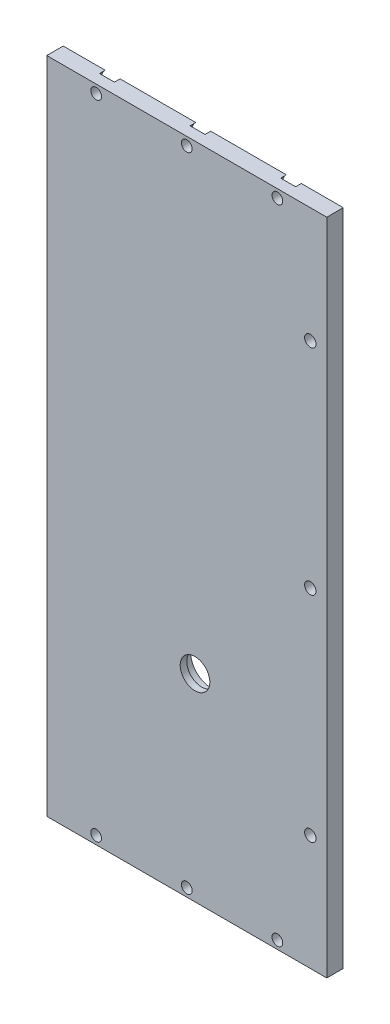
ISO-10303-21;
HEADER;
FILE_DESCRIPTION(('STEP AP214'),'2;1');
FILE_NAME('part.step','',(''),(''),'','','');
FILE_SCHEMA(('AUTOMOTIVE_DESIGN { 1 0 10303 214 1 1 1 1 }'));
ENDSEC;
DATA;
#1=APPLICATION_CONTEXT('core data for automotive mechanical design processes');
#2=APPLICATION_PROTOCOL_DEFINITION('international standard','automotive_design',2000,#1);
#3=PRODUCT_CONTEXT('',#1,'mechanical');
#4=PRODUCT('Part','Part','',(#3));
#5=PRODUCT_RELATED_PRODUCT_CATEGORY('part','',(#4));
#6=PRODUCT_DEFINITION_FORMATION('','',#4);
#7=PRODUCT_DEFINITION_CONTEXT('part definition',#1,'design');
#8=PRODUCT_DEFINITION('design','',#6,#7);
#9=PRODUCT_DEFINITION_SHAPE('','',#8);
#10=(LENGTH_UNIT() NAMED_UNIT(*) SI_UNIT(.MILLI.,.METRE.));
#11=(NAMED_UNIT(*) PLANE_ANGLE_UNIT() SI_UNIT($,.RADIAN.));
#12=(NAMED_UNIT(*) SI_UNIT($,.STERADIAN.) SOLID_ANGLE_UNIT());
#13=UNCERTAINTY_MEASURE_WITH_UNIT(LENGTH_MEASURE(1.E-05),#10,'distance_accuracy_value','');
#14=(GEOMETRIC_REPRESENTATION_CONTEXT(3) GLOBAL_UNCERTAINTY_ASSIGNED_CONTEXT((#13)) GLOBAL_UNIT_ASSIGNED_CONTEXT((#10,
#11,#12)) REPRESENTATION_CONTEXT('',''));
#15=CARTESIAN_POINT('',(0.,0.,0.));
#16=DIRECTION('',(0.,0.,1.));
#17=DIRECTION('',(1.,0.,0.));
#18=AXIS2_PLACEMENT_3D('',#15,#16,#17);
#19=CARTESIAN_POINT('',(0.,0.,0.));
#20=DIRECTION('',(0.,0.,1.));
#21=DIRECTION('',(1.,0.,0.));
#22=AXIS2_PLACEMENT_3D('',#19,#20,#21);
#23=PLANE('',#22);
#24=CARTESIAN_POINT('',(-113.363171355499,-48.1585677749361,0.));
#25=DIRECTION('',(0.,0.,-1.));
#26=DIRECTION('',(-1.,0.,0.));
#27=AXIS2_PLACEMENT_3D('',#24,#25,#26);
#28=CIRCLE('',#27,6.35);
#29=CARTESIAN_POINT('',(-119.713171355499,-48.1585677749361,0.));
#30=VERTEX_POINT('',#29);
#31=EDGE_CURVE('E704',#30,#30,#28,.T.);
#32=ORIENTED_EDGE('',*,*,#31,.F.);
#33=EDGE_LOOP('',(#32));
#34=FACE_BOUND('',#33,.T.);
#35=CARTESIAN_POINT('',(-78.3631713554987,-73.1585677749361,0.));
#36=DIRECTION('',(0.,0.,-1.));
#37=DIRECTION('',(-1.,0.,0.));
#38=AXIS2_PLACEMENT_3D('',#35,#36,#37);
#39=CIRCLE('',#38,3.37311999999999);
#40=CARTESIAN_POINT('',(-81.7362913554987,-73.1585677749361,0.));
#41=VERTEX_POINT('',#40);
#42=EDGE_CURVE('E312',#41,#41,#39,.T.);
#43=ORIENTED_EDGE('',*,*,#42,.F.);
#44=EDGE_LOOP('',(#43));
#45=FACE_BOUND('',#44,.T.);
#46=CARTESIAN_POINT('',(-78.3631713554987,-8.15856777493607,0.));
#47=DIRECTION('',(0.,0.,-1.));
#48=DIRECTION('',(-1.,0.,0.));
#49=AXIS2_PLACEMENT_3D('',#46,#47,#48);
#50=CIRCLE('',#49,3.37311999999999);
#51=CARTESIAN_POINT('',(-81.7362913554987,-8.15856777493607,0.));
#52=VERTEX_POINT('',#51);
#53=EDGE_CURVE('E296',#52,#52,#50,.T.);
#54=ORIENTED_EDGE('',*,*,#53,.F.);
#55=EDGE_LOOP('',(#54));
#56=FACE_BOUND('',#55,.T.);
#57=CARTESIAN_POINT('',(-78.3631713554987,56.8414322250639,0.));
#58=DIRECTION('',(0.,0.,-1.));
#59=DIRECTION('',(-1.,0.,0.));
#60=AXIS2_PLACEMENT_3D('',#57,#58,#59);
#61=CIRCLE('',#60,3.37311999999999);
#62=CARTESIAN_POINT('',(-81.7362913554987,56.8414322250639,0.));
#63=VERTEX_POINT('',#62);
#64=EDGE_CURVE('E280',#63,#63,#61,.T.);
#65=ORIENTED_EDGE('',*,*,#64,.F.);
#66=EDGE_LOOP('',(#65));
#67=FACE_BOUND('',#66,.T.);
#68=CARTESIAN_POINT('',(-88.3631713554986,89.341432225064,0.));
#69=DIRECTION('',(0.,0.,-1.));
#70=DIRECTION('',(-1.,0.,0.));
#71=AXIS2_PLACEMENT_3D('',#68,#69,#70);
#72=CIRCLE('',#71,3.37311999999999);
#73=CARTESIAN_POINT('',(-86.0986761502928,91.8414322250639,0.));
#74=VERTEX_POINT('',#73);
#75=CARTESIAN_POINT('',(-90.6276665607044,91.8414322250639,0.));
#76=VERTEX_POINT('',#75);
#77=EDGE_CURVE('E193',#74,#76,#72,.T.);
#78=ORIENTED_EDGE('',*,*,#77,.F.);
#79=DIRECTION('',(-1.,0.,0.));
#80=VECTOR('',#79,1.);
#81=CARTESIAN_POINT('',(-158.363171355499,91.8414322250639,0.));
#82=LINE('',#81,#80);
#83=CARTESIAN_POINT('',(-73.3631713554987,91.8414322250639,0.));
#84=VERTEX_POINT('',#83);
#85=EDGE_CURVE('E334',#84,#74,#82,.T.);
#86=ORIENTED_EDGE('',*,*,#85,.F.);
#87=DIRECTION('',(0.,1.,0.));
#88=VECTOR('',#87,1.);
#89=CARTESIAN_POINT('',(-73.3631713554987,91.8414322250639,0.));
#90=LINE('',#89,#88);
#91=CARTESIAN_POINT('',(-73.3631713554987,-108.158567774936,0.));
#92=VERTEX_POINT('',#91);
#93=EDGE_CURVE('E352',#92,#84,#90,.T.);
#94=ORIENTED_EDGE('',*,*,#93,.F.);
#95=DIRECTION('',(1.,0.,0.));
#96=VECTOR('',#95,1.);
#97=CARTESIAN_POINT('',(-158.363171355499,-108.158567774936,0.));
#98=LINE('',#97,#96);
#99=CARTESIAN_POINT('',(-86.0986761502929,-108.158567774936,0.));
#100=VERTEX_POINT('',#99);
#101=EDGE_CURVE('E347',#100,#92,#98,.T.);
#102=ORIENTED_EDGE('',*,*,#101,.F.);
#103=CARTESIAN_POINT('',(-88.3631713554987,-105.658567774936,0.));
#104=DIRECTION('',(0.,0.,-1.));
#105=DIRECTION('',(-1.,0.,0.));
#106=AXIS2_PLACEMENT_3D('',#103,#104,#105);
#107=CIRCLE('',#106,3.37311999999999);
#108=CARTESIAN_POINT('',(-90.6276665607044,-108.158567774936,0.));
#109=VERTEX_POINT('',#108);
#110=EDGE_CURVE('E265',#109,#100,#107,.T.);
#111=ORIENTED_EDGE('',*,*,#110,.F.);
#112=CARTESIAN_POINT('',(-113.598676150293,-108.158567774936,0.));
#113=VERTEX_POINT('',#112);
#114=EDGE_CURVE('E628',#113,#109,#98,.T.);
#115=ORIENTED_EDGE('',*,*,#114,.F.);
#116=CARTESIAN_POINT('',(-115.863171355499,-105.658567774936,0.));
#117=DIRECTION('',(0.,0.,-1.));
#118=DIRECTION('',(-1.,0.,0.));
#119=AXIS2_PLACEMENT_3D('',#116,#117,#118);
#120=CIRCLE('',#119,3.37311999999999);
#121=CARTESIAN_POINT('',(-118.127666560704,-108.158567774936,0.));
#122=VERTEX_POINT('',#121);
#123=EDGE_CURVE('E250',#122,#113,#120,.T.);
#124=ORIENTED_EDGE('',*,*,#123,.F.);
#125=CARTESIAN_POINT('',(-141.098676150293,-108.158567774936,0.));
#126=VERTEX_POINT('',#125);
#127=EDGE_CURVE('E353',#126,#122,#98,.T.);
#128=ORIENTED_EDGE('',*,*,#127,.F.);
#129=CARTESIAN_POINT('',(-143.363171355499,-105.658567774936,0.));
#130=DIRECTION('',(0.,0.,-1.));
#131=DIRECTION('',(-1.,0.,0.));
#132=AXIS2_PLACEMENT_3D('',#129,#130,#131);
#133=CIRCLE('',#132,3.37312000000001);
#134=CARTESIAN_POINT('',(-145.627666560704,-108.158567774936,0.));
#135=VERTEX_POINT('',#134);
#136=EDGE_CURVE('E236',#135,#126,#133,.T.);
#137=ORIENTED_EDGE('',*,*,#136,.F.);
#138=CARTESIAN_POINT('',(-158.363171355499,-108.158567774936,0.));
#139=VERTEX_POINT('',#138);
#140=EDGE_CURVE('E348',#139,#135,#98,.T.);
#141=ORIENTED_EDGE('',*,*,#140,.F.);
#142=DIRECTION('',(0.,-1.,0.));
#143=VECTOR('',#142,1.);
#144=CARTESIAN_POINT('',(-158.363171355499,91.8414322250639,0.));
#145=LINE('',#144,#143);
#146=CARTESIAN_POINT('',(-158.363171355499,91.8414322250639,0.));
#147=VERTEX_POINT('',#146);
#148=EDGE_CURVE('E328',#147,#139,#145,.T.);
#149=ORIENTED_EDGE('',*,*,#148,.F.);
#150=CARTESIAN_POINT('',(-145.627666560704,91.8414322250639,0.));
#151=VERTEX_POINT('',#150);
#152=EDGE_CURVE('E356',#151,#147,#82,.T.);
#153=ORIENTED_EDGE('',*,*,#152,.F.);
#154=CARTESIAN_POINT('',(-143.363171355499,89.341432225064,0.));
#155=DIRECTION('',(0.,0.,-1.));
#156=DIRECTION('',(-1.,0.,0.));
#157=AXIS2_PLACEMENT_3D('',#154,#155,#156);
#158=CIRCLE('',#157,3.37312000000001);
#159=CARTESIAN_POINT('',(-141.098676150293,91.8414322250639,0.));
#160=VERTEX_POINT('',#159);
#161=EDGE_CURVE('E220',#160,#151,#158,.T.);
#162=ORIENTED_EDGE('',*,*,#161,.F.);
#163=CARTESIAN_POINT('',(-118.127666560704,91.8414322250639,0.));
#164=VERTEX_POINT('',#163);
#165=EDGE_CURVE('E505',#164,#160,#82,.T.);
#166=ORIENTED_EDGE('',*,*,#165,.F.);
#167=CARTESIAN_POINT('',(-115.863171355499,89.341432225064,0.));
#168=DIRECTION('',(0.,0.,-1.));
#169=DIRECTION('',(-1.,0.,0.));
#170=AXIS2_PLACEMENT_3D('',#167,#168,#169);
#171=CIRCLE('',#170,3.37311999999999);
#172=CARTESIAN_POINT('',(-113.598676150293,91.8414322250639,0.));
#173=VERTEX_POINT('',#172);
#174=EDGE_CURVE('E206',#173,#164,#171,.T.);
#175=ORIENTED_EDGE('',*,*,#174,.F.);
#176=EDGE_CURVE('E360',#76,#173,#82,.T.);
#177=ORIENTED_EDGE('',*,*,#176,.F.);
#178=EDGE_LOOP('',(#78,#86,#94,#102,#111,#115,#124,#128,#137,#141,#149,#153,#162,#166,#175,#177));
#179=FACE_BOUND('',#178,.T.);
#180=ADVANCED_FACE('F47',(#34,#45,#56,#67,#179),#23,.F.);
#181=CARTESIAN_POINT('',(-158.363171355499,91.8414322250639,5.));
#182=DIRECTION('',(1.,0.,0.));
#183=DIRECTION('',(0.,1.,0.));
#184=AXIS2_PLACEMENT_3D('',#181,#182,#183);
#185=PLANE('',#184);
#186=CARTESIAN_POINT('',(-158.363171355499,-58.1585677749361,2.50000000000001));
#187=DIRECTION('',(-1.,0.,0.));
#188=DIRECTION('',(0.,0.,1.));
#189=AXIS2_PLACEMENT_3D('',#186,#187,#188);
#190=CIRCLE('',#189,1.13029999999999);
#191=CARTESIAN_POINT('',(-158.363171355499,-58.1585677749361,3.63029999999999));
#192=VERTEX_POINT('',#191);
#193=EDGE_CURVE('E178',#192,#192,#190,.T.);
#194=ORIENTED_EDGE('',*,*,#193,.F.);
#195=EDGE_LOOP('',(#194));
#196=FACE_BOUND('',#195,.T.);
#197=CARTESIAN_POINT('',(-158.363171355499,41.8414322250639,2.50000000000001));
#198=DIRECTION('',(-1.,0.,0.));
#199=DIRECTION('',(0.,0.,1.));
#200=AXIS2_PLACEMENT_3D('',#197,#198,#199);
#201=CIRCLE('',#200,1.13029999999999);
#202=CARTESIAN_POINT('',(-158.363171355499,41.8414322250639,3.63029999999999));
#203=VERTEX_POINT('',#202);
#204=EDGE_CURVE('E177',#203,#203,#201,.T.);
#205=ORIENTED_EDGE('',*,*,#204,.F.);
#206=EDGE_LOOP('',(#205));
#207=FACE_BOUND('',#206,.T.);
#208=ORIENTED_EDGE('',*,*,#148,.T.);
#209=DIRECTION('',(0.,0.,-1.));
#210=VECTOR('',#209,1.);
#211=CARTESIAN_POINT('',(-158.363171355499,-108.158567774936,5.));
#212=LINE('',#211,#210);
#213=CARTESIAN_POINT('',(-158.363171355499,-108.158567774936,5.));
#214=VERTEX_POINT('',#213);
#215=EDGE_CURVE('E372',#214,#139,#212,.T.);
#216=ORIENTED_EDGE('',*,*,#215,.F.);
#217=DIRECTION('',(0.,-1.,0.));
#218=VECTOR('',#217,1.);
#219=CARTESIAN_POINT('',(-158.363171355499,91.8414322250639,5.));
#220=LINE('',#219,#218);
#221=CARTESIAN_POINT('',(-158.363171355499,91.8414322250639,5.));
#222=VERTEX_POINT('',#221);
#223=EDGE_CURVE('E329',#222,#214,#220,.T.);
#224=ORIENTED_EDGE('',*,*,#223,.F.);
#225=DIRECTION('',(0.,0.,-1.));
#226=VECTOR('',#225,1.);
#227=CARTESIAN_POINT('',(-158.363171355499,91.8414322250639,5.));
#228=LINE('',#227,#226);
#229=EDGE_CURVE('E343',#222,#147,#228,.T.);
#230=ORIENTED_EDGE('',*,*,#229,.T.);
#231=EDGE_LOOP('',(#208,#216,#224,#230));
#232=FACE_BOUND('',#231,.T.);
#233=ADVANCED_FACE('F49',(#196,#207,#232),#185,.F.);
#234=CARTESIAN_POINT('',(-158.363171355499,-108.158567774936,5.));
#235=DIRECTION('',(0.,1.,0.));
#236=DIRECTION('',(0.,0.,1.));
#237=AXIS2_PLACEMENT_3D('',#234,#235,#236);
#238=PLANE('',#237);
#239=DIRECTION('',(1.,0.,0.));
#240=VECTOR('',#239,1.);
#241=CARTESIAN_POINT('',(-158.363171355499,-108.158567774936,1.7272));
#242=LINE('',#241,#240);
#243=CARTESIAN_POINT('',(-145.627666560704,-108.158567774936,1.7272));
#244=VERTEX_POINT('',#243);
#245=CARTESIAN_POINT('',(-141.098676150293,-108.158567774936,1.7272));
#246=VERTEX_POINT('',#245);
#247=EDGE_CURVE('E400',#244,#246,#242,.T.);
#248=ORIENTED_EDGE('',*,*,#247,.T.);
#249=DIRECTION('',(0.,0.,-1.));
#250=VECTOR('',#249,1.);
#251=CARTESIAN_POINT('',(-141.098676150293,-108.158567774936,0.));
#252=LINE('',#251,#250);
#253=EDGE_CURVE('E224',#246,#126,#252,.T.);
#254=ORIENTED_EDGE('',*,*,#253,.T.);
#255=ORIENTED_EDGE('',*,*,#127,.T.);
#256=DIRECTION('',(0.,0.,-1.));
#257=VECTOR('',#256,1.);
#258=CARTESIAN_POINT('',(-118.127666560704,-108.158567774936,0.));
#259=LINE('',#258,#257);
#260=CARTESIAN_POINT('',(-118.127666560704,-108.158567774936,1.7272));
#261=VERTEX_POINT('',#260);
#262=EDGE_CURVE('E388',#122,#261,#259,.F.);
#263=ORIENTED_EDGE('',*,*,#262,.T.);
#264=DIRECTION('',(1.,0.,0.));
#265=VECTOR('',#264,1.);
#266=CARTESIAN_POINT('',(-158.363171355499,-108.158567774936,1.7272));
#267=LINE('',#266,#265);
#268=CARTESIAN_POINT('',(-113.598676150293,-108.158567774936,1.7272));
#269=VERTEX_POINT('',#268);
#270=EDGE_CURVE('E392',#261,#269,#267,.T.);
#271=ORIENTED_EDGE('',*,*,#270,.T.);
#272=DIRECTION('',(0.,0.,-1.));
#273=VECTOR('',#272,1.);
#274=CARTESIAN_POINT('',(-113.598676150293,-108.158567774936,0.));
#275=LINE('',#274,#273);
#276=EDGE_CURVE('E396',#269,#113,#275,.T.);
#277=ORIENTED_EDGE('',*,*,#276,.T.);
#278=ORIENTED_EDGE('',*,*,#114,.T.);
#279=DIRECTION('',(0.,0.,-1.));
#280=VECTOR('',#279,1.);
#281=CARTESIAN_POINT('',(-90.6276665607044,-108.158567774936,0.));
#282=LINE('',#281,#280);
#283=CARTESIAN_POINT('',(-90.6276665607044,-108.158567774936,1.7272));
#284=VERTEX_POINT('',#283);
#285=EDGE_CURVE('E376',#109,#284,#282,.F.);
#286=ORIENTED_EDGE('',*,*,#285,.T.);
#287=DIRECTION('',(1.,0.,0.));
#288=VECTOR('',#287,1.);
#289=CARTESIAN_POINT('',(-158.363171355499,-108.158567774936,1.7272));
#290=LINE('',#289,#288);
#291=CARTESIAN_POINT('',(-86.0986761502929,-108.158567774936,1.7272));
#292=VERTEX_POINT('',#291);
#293=EDGE_CURVE('E380',#284,#292,#290,.T.);
#294=ORIENTED_EDGE('',*,*,#293,.T.);
#295=DIRECTION('',(0.,0.,-1.));
#296=VECTOR('',#295,1.);
#297=CARTESIAN_POINT('',(-86.0986761502929,-108.158567774936,0.));
#298=LINE('',#297,#296);
#299=EDGE_CURVE('E384',#292,#100,#298,.T.);
#300=ORIENTED_EDGE('',*,*,#299,.T.);
#301=ORIENTED_EDGE('',*,*,#101,.T.);
#302=DIRECTION('',(0.,0.,-1.));
#303=VECTOR('',#302,1.);
#304=CARTESIAN_POINT('',(-73.3631713554987,-108.158567774936,5.));
#305=LINE('',#304,#303);
#306=CARTESIAN_POINT('',(-73.3631713554987,-108.158567774936,5.));
#307=VERTEX_POINT('',#306);
#308=EDGE_CURVE('E368',#307,#92,#305,.T.);
#309=ORIENTED_EDGE('',*,*,#308,.F.);
#310=DIRECTION('',(1.,0.,0.));
#311=VECTOR('',#310,1.);
#312=CARTESIAN_POINT('',(-158.363171355499,-108.158567774936,5.));
#313=LINE('',#312,#311);
#314=EDGE_CURVE('E333',#214,#307,#313,.T.);
#315=ORIENTED_EDGE('',*,*,#314,.F.);
#316=ORIENTED_EDGE('',*,*,#215,.T.);
#317=ORIENTED_EDGE('',*,*,#140,.T.);
#318=DIRECTION('',(0.,0.,-1.));
#319=VECTOR('',#318,1.);
#320=CARTESIAN_POINT('',(-145.627666560704,-108.158567774936,0.));
#321=LINE('',#320,#319);
#322=EDGE_CURVE('E404',#135,#244,#321,.F.);
#323=ORIENTED_EDGE('',*,*,#322,.T.);
#324=EDGE_LOOP('',(#248,#254,#255,#263,#271,#277,#278,#286,#294,#300,#301,#309,#315,#316,#317,#323));
#325=FACE_BOUND('',#324,.T.);
#326=ADVANCED_FACE('F467',(#325),#238,.F.);
#327=CARTESIAN_POINT('',(-73.3631713554987,91.8414322250639,5.));
#328=DIRECTION('',(-1.,0.,0.));
#329=DIRECTION('',(0.,-1.,0.));
#330=AXIS2_PLACEMENT_3D('',#327,#328,#329);
#331=PLANE('',#330);
#332=ORIENTED_EDGE('',*,*,#93,.T.);
#333=DIRECTION('',(0.,0.,-1.));
#334=VECTOR('',#333,1.);
#335=CARTESIAN_POINT('',(-73.3631713554987,91.8414322250639,5.));
#336=LINE('',#335,#334);
#337=CARTESIAN_POINT('',(-73.3631713554987,91.8414322250639,5.));
#338=VERTEX_POINT('',#337);
#339=EDGE_CURVE('E364',#338,#84,#336,.T.);
#340=ORIENTED_EDGE('',*,*,#339,.F.);
#341=DIRECTION('',(0.,1.,0.));
#342=VECTOR('',#341,1.);
#343=CARTESIAN_POINT('',(-73.3631713554987,91.8414322250639,5.));
#344=LINE('',#343,#342);
#345=EDGE_CURVE('E337',#307,#338,#344,.T.);
#346=ORIENTED_EDGE('',*,*,#345,.F.);
#347=ORIENTED_EDGE('',*,*,#308,.T.);
#348=EDGE_LOOP('',(#332,#340,#346,#347));
#349=FACE_BOUND('',#348,.T.);
#350=ADVANCED_FACE('F477',(#349),#331,.F.);
#351=CARTESIAN_POINT('',(-158.363171355499,91.8414322250639,5.));
#352=DIRECTION('',(0.,-1.,0.));
#353=DIRECTION('',(0.,0.,-1.));
#354=AXIS2_PLACEMENT_3D('',#351,#352,#353);
#355=PLANE('',#354);
#356=DIRECTION('',(-1.,0.,0.));
#357=VECTOR('',#356,1.);
#358=CARTESIAN_POINT('',(-158.363171355499,91.8414322250639,1.7272));
#359=LINE('',#358,#357);
#360=CARTESIAN_POINT('',(-86.0986761502928,91.8414322250639,1.7272));
#361=VERTEX_POINT('',#360);
#362=CARTESIAN_POINT('',(-90.6276665607044,91.8414322250639,1.7272));
#363=VERTEX_POINT('',#362);
#364=EDGE_CURVE('E57',#361,#363,#359,.T.);
#365=ORIENTED_EDGE('',*,*,#364,.T.);
#366=DIRECTION('',(0.,0.,-1.));
#367=VECTOR('',#366,1.);
#368=CARTESIAN_POINT('',(-90.6276665607044,91.8414322250639,0.));
#369=LINE('',#368,#367);
#370=EDGE_CURVE('E12',#363,#76,#369,.T.);
#371=ORIENTED_EDGE('',*,*,#370,.T.);
#372=ORIENTED_EDGE('',*,*,#176,.T.);
#373=DIRECTION('',(0.,0.,-1.));
#374=VECTOR('',#373,1.);
#375=CARTESIAN_POINT('',(-113.598676150293,91.8414322250639,0.));
#376=LINE('',#375,#374);
#377=CARTESIAN_POINT('',(-113.598676150293,91.8414322250639,1.7272));
#378=VERTEX_POINT('',#377);
#379=EDGE_CURVE('E426',#173,#378,#376,.F.);
#380=ORIENTED_EDGE('',*,*,#379,.T.);
#381=DIRECTION('',(-1.,0.,0.));
#382=VECTOR('',#381,1.);
#383=CARTESIAN_POINT('',(-158.363171355499,91.8414322250639,1.7272));
#384=LINE('',#383,#382);
#385=CARTESIAN_POINT('',(-118.127666560704,91.8414322250639,1.7272));
#386=VERTEX_POINT('',#385);
#387=EDGE_CURVE('E422',#378,#386,#384,.T.);
#388=ORIENTED_EDGE('',*,*,#387,.T.);
#389=DIRECTION('',(0.,0.,-1.));
#390=VECTOR('',#389,1.);
#391=CARTESIAN_POINT('',(-118.127666560704,91.8414322250639,0.));
#392=LINE('',#391,#390);
#393=EDGE_CURVE('E430',#386,#164,#392,.T.);
#394=ORIENTED_EDGE('',*,*,#393,.T.);
#395=ORIENTED_EDGE('',*,*,#165,.T.);
#396=DIRECTION('',(0.,0.,-1.));
#397=VECTOR('',#396,1.);
#398=CARTESIAN_POINT('',(-141.098676150293,91.8414322250639,0.));
#399=LINE('',#398,#397);
#400=CARTESIAN_POINT('',(-141.098676150293,91.8414322250639,1.7272));
#401=VERTEX_POINT('',#400);
#402=EDGE_CURVE('E223',#160,#401,#399,.F.);
#403=ORIENTED_EDGE('',*,*,#402,.T.);
#404=DIRECTION('',(-1.,0.,0.));
#405=VECTOR('',#404,1.);
#406=CARTESIAN_POINT('',(-158.363171355499,91.8414322250639,1.7272));
#407=LINE('',#406,#405);
#408=CARTESIAN_POINT('',(-145.627666560704,91.8414322250639,1.7272));
#409=VERTEX_POINT('',#408);
#410=EDGE_CURVE('E414',#401,#409,#407,.T.);
#411=ORIENTED_EDGE('',*,*,#410,.T.);
#412=DIRECTION('',(0.,0.,-1.));
#413=VECTOR('',#412,1.);
#414=CARTESIAN_POINT('',(-145.627666560704,91.8414322250639,0.));
#415=LINE('',#414,#413);
#416=EDGE_CURVE('E418',#409,#151,#415,.T.);
#417=ORIENTED_EDGE('',*,*,#416,.T.);
#418=ORIENTED_EDGE('',*,*,#152,.T.);
#419=ORIENTED_EDGE('',*,*,#229,.F.);
#420=DIRECTION('',(-1.,0.,0.));
#421=VECTOR('',#420,1.);
#422=CARTESIAN_POINT('',(-158.363171355499,91.8414322250639,5.));
#423=LINE('',#422,#421);
#424=EDGE_CURVE('E340',#338,#222,#423,.T.);
#425=ORIENTED_EDGE('',*,*,#424,.F.);
#426=ORIENTED_EDGE('',*,*,#339,.T.);
#427=ORIENTED_EDGE('',*,*,#85,.T.);
#428=DIRECTION('',(0.,0.,-1.));
#429=VECTOR('',#428,1.);
#430=CARTESIAN_POINT('',(-86.0986761502928,91.8414322250639,0.));
#431=LINE('',#430,#429);
#432=EDGE_CURVE('E434',#74,#361,#431,.F.);
#433=ORIENTED_EDGE('',*,*,#432,.T.);
#434=EDGE_LOOP('',(#365,#371,#372,#380,#388,#394,#395,#403,#411,#417,#418,#419,#425,#426,#427,#433));
#435=FACE_BOUND('',#434,.T.);
#436=ADVANCED_FACE('F441',(#435),#355,.F.);
#437=CARTESIAN_POINT('',(0.,0.,5.));
#438=DIRECTION('',(0.,0.,1.));
#439=DIRECTION('',(1.,0.,0.));
#440=AXIS2_PLACEMENT_3D('',#437,#438,#439);
#441=PLANE('',#440);
#442=CARTESIAN_POINT('',(-113.363171355499,-48.1585677749361,5.));
#443=DIRECTION('',(0.,0.,-1.));
#444=DIRECTION('',(-1.,0.,0.));
#445=AXIS2_PLACEMENT_3D('',#442,#443,#444);
#446=CIRCLE('',#445,4.49999999999999);
#447=CARTESIAN_POINT('',(-117.863171355499,-48.1585677749361,5.));
#448=VERTEX_POINT('',#447);
#449=EDGE_CURVE('E186',#448,#448,#446,.T.);
#450=ORIENTED_EDGE('',*,*,#449,.T.);
#451=EDGE_LOOP('',(#450));
#452=FACE_BOUND('',#451,.T.);
#453=CARTESIAN_POINT('',(-88.3631713554986,89.341432225064,5.));
#454=DIRECTION('',(0.,0.,1.));
#455=DIRECTION('',(1.,0.,0.));
#456=AXIS2_PLACEMENT_3D('',#453,#454,#455);
#457=CIRCLE('',#456,1.63195);
#458=CARTESIAN_POINT('',(-86.7312213554986,89.341432225064,5.));
#459=VERTEX_POINT('',#458);
#460=EDGE_CURVE('E202',#459,#459,#457,.T.);
#461=ORIENTED_EDGE('',*,*,#460,.F.);
#462=EDGE_LOOP('',(#461));
#463=FACE_BOUND('',#462,.T.);
#464=CARTESIAN_POINT('',(-115.863171355499,89.341432225064,5.));
#465=DIRECTION('',(0.,0.,1.));
#466=DIRECTION('',(1.,0.,0.));
#467=AXIS2_PLACEMENT_3D('',#464,#465,#466);
#468=CIRCLE('',#467,1.63195);
#469=CARTESIAN_POINT('',(-114.231221355499,89.341432225064,5.));
#470=VERTEX_POINT('',#469);
#471=EDGE_CURVE('E215',#470,#470,#468,.T.);
#472=ORIENTED_EDGE('',*,*,#471,.F.);
#473=EDGE_LOOP('',(#472));
#474=FACE_BOUND('',#473,.T.);
#475=CARTESIAN_POINT('',(-143.363171355499,89.341432225064,5.));
#476=DIRECTION('',(0.,0.,1.));
#477=DIRECTION('',(1.,0.,0.));
#478=AXIS2_PLACEMENT_3D('',#475,#476,#477);
#479=CIRCLE('',#478,1.63194999999999);
#480=CARTESIAN_POINT('',(-141.731221355499,89.341432225064,5.));
#481=VERTEX_POINT('',#480);
#482=EDGE_CURVE('E232',#481,#481,#479,.T.);
#483=ORIENTED_EDGE('',*,*,#482,.F.);
#484=EDGE_LOOP('',(#483));
#485=FACE_BOUND('',#484,.T.);
#486=CARTESIAN_POINT('',(-143.363171355499,-105.658567774936,5.));
#487=DIRECTION('',(0.,0.,1.));
#488=DIRECTION('',(1.,0.,0.));
#489=AXIS2_PLACEMENT_3D('',#486,#487,#488);
#490=CIRCLE('',#489,1.63194999999999);
#491=CARTESIAN_POINT('',(-141.731221355499,-105.658567774936,5.));
#492=VERTEX_POINT('',#491);
#493=EDGE_CURVE('E246',#492,#492,#490,.T.);
#494=ORIENTED_EDGE('',*,*,#493,.F.);
#495=EDGE_LOOP('',(#494));
#496=FACE_BOUND('',#495,.T.);
#497=CARTESIAN_POINT('',(-115.863171355499,-105.658567774936,5.));
#498=DIRECTION('',(0.,0.,1.));
#499=DIRECTION('',(1.,0.,0.));
#500=AXIS2_PLACEMENT_3D('',#497,#498,#499);
#501=CIRCLE('',#500,1.63195);
#502=CARTESIAN_POINT('',(-114.231221355499,-105.658567774936,5.));
#503=VERTEX_POINT('',#502);
#504=EDGE_CURVE('E261',#503,#503,#501,.T.);
#505=ORIENTED_EDGE('',*,*,#504,.F.);
#506=EDGE_LOOP('',(#505));
#507=FACE_BOUND('',#506,.T.);
#508=CARTESIAN_POINT('',(-88.3631713554987,-105.658567774936,5.));
#509=DIRECTION('',(0.,0.,1.));
#510=DIRECTION('',(1.,0.,0.));
#511=AXIS2_PLACEMENT_3D('',#508,#509,#510);
#512=CIRCLE('',#511,1.63195);
#513=CARTESIAN_POINT('',(-86.7312213554987,-105.658567774936,5.));
#514=VERTEX_POINT('',#513);
#515=EDGE_CURVE('E276',#514,#514,#512,.T.);
#516=ORIENTED_EDGE('',*,*,#515,.F.);
#517=EDGE_LOOP('',(#516));
#518=FACE_BOUND('',#517,.T.);
#519=CARTESIAN_POINT('',(-78.3631713554987,56.8414322250639,5.));
#520=DIRECTION('',(0.,0.,-1.));
#521=DIRECTION('',(-1.,0.,0.));
#522=AXIS2_PLACEMENT_3D('',#519,#520,#521);
#523=CIRCLE('',#522,1.7272);
#524=CARTESIAN_POINT('',(-80.0903713554986,56.8414322250639,5.));
#525=VERTEX_POINT('',#524);
#526=EDGE_CURVE('E292',#525,#525,#523,.T.);
#527=ORIENTED_EDGE('',*,*,#526,.T.);
#528=EDGE_LOOP('',(#527));
#529=FACE_BOUND('',#528,.T.);
#530=CARTESIAN_POINT('',(-78.3631713554987,-8.15856777493607,5.));
#531=DIRECTION('',(0.,0.,-1.));
#532=DIRECTION('',(-1.,0.,0.));
#533=AXIS2_PLACEMENT_3D('',#530,#531,#532);
#534=CIRCLE('',#533,1.7272);
#535=CARTESIAN_POINT('',(-80.0903713554986,-8.15856777493607,5.));
#536=VERTEX_POINT('',#535);
#537=EDGE_CURVE('E308',#536,#536,#534,.T.);
#538=ORIENTED_EDGE('',*,*,#537,.T.);
#539=EDGE_LOOP('',(#538));
#540=FACE_BOUND('',#539,.T.);
#541=CARTESIAN_POINT('',(-78.3631713554987,-73.1585677749361,5.));
#542=DIRECTION('',(0.,0.,-1.));
#543=DIRECTION('',(-1.,0.,0.));
#544=AXIS2_PLACEMENT_3D('',#541,#542,#543);
#545=CIRCLE('',#544,1.7272);
#546=CARTESIAN_POINT('',(-80.0903713554986,-73.1585677749361,5.));
#547=VERTEX_POINT('',#546);
#548=EDGE_CURVE('E324',#547,#547,#545,.T.);
#549=ORIENTED_EDGE('',*,*,#548,.T.);
#550=EDGE_LOOP('',(#549));
#551=FACE_BOUND('',#550,.T.);
#552=ORIENTED_EDGE('',*,*,#223,.T.);
#553=ORIENTED_EDGE('',*,*,#314,.T.);
#554=ORIENTED_EDGE('',*,*,#345,.T.);
#555=ORIENTED_EDGE('',*,*,#424,.T.);
#556=EDGE_LOOP('',(#552,#553,#554,#555));
#557=FACE_BOUND('',#556,.T.);
#558=ADVANCED_FACE('F473',(#452,#463,#474,#485,#496,#507,#518,#529,#540,#551,#557),#441,.T.);
#559=CARTESIAN_POINT('',(-78.3631713554987,-73.1585677749361,0.));
#560=DIRECTION('',(0.,0.,-1.));
#561=DIRECTION('',(-1.,0.,0.));
#562=AXIS2_PLACEMENT_3D('',#559,#560,#561);
#563=CYLINDRICAL_SURFACE('',#562,1.7272);
#564=ORIENTED_EDGE('',*,*,#548,.F.);
#565=EDGE_LOOP('',(#564));
#566=FACE_BOUND('',#565,.T.);
#567=CARTESIAN_POINT('',(-78.3631713554987,-73.1585677749361,1.7272));
#568=DIRECTION('',(0.,0.,-1.));
#569=DIRECTION('',(-1.,0.,0.));
#570=AXIS2_PLACEMENT_3D('',#567,#568,#569);
#571=CIRCLE('',#570,1.7272);
#572=CARTESIAN_POINT('',(-80.0903713554986,-73.1585677749361,1.7272));
#573=VERTEX_POINT('',#572);
#574=EDGE_CURVE('E320',#573,#573,#571,.T.);
#575=ORIENTED_EDGE('',*,*,#574,.T.);
#576=EDGE_LOOP('',(#575));
#577=FACE_BOUND('',#576,.T.);
#578=ADVANCED_FACE('F597',(#566,#577),#563,.F.);
#579=CARTESIAN_POINT('',(-76.6359713554987,-73.1585677749361,1.7272));
#580=DIRECTION('',(0.,0.,1.));
#581=DIRECTION('',(1.,0.,0.));
#582=AXIS2_PLACEMENT_3D('',#579,#580,#581);
#583=PLANE('',#582);
#584=ORIENTED_EDGE('',*,*,#574,.F.);
#585=EDGE_LOOP('',(#584));
#586=FACE_BOUND('',#585,.T.);
#587=CARTESIAN_POINT('',(-78.3631713554987,-73.1585677749361,1.7272));
#588=DIRECTION('',(0.,0.,-1.));
#589=DIRECTION('',(-1.,0.,0.));
#590=AXIS2_PLACEMENT_3D('',#587,#588,#589);
#591=CIRCLE('',#590,3.37311999999999);
#592=CARTESIAN_POINT('',(-81.7362913554987,-73.1585677749361,1.7272));
#593=VERTEX_POINT('',#592);
#594=EDGE_CURVE('E316',#593,#593,#591,.T.);
#595=ORIENTED_EDGE('',*,*,#594,.T.);
#596=EDGE_LOOP('',(#595));
#597=FACE_BOUND('',#596,.T.);
#598=ADVANCED_FACE('F594',(#586,#597),#583,.F.);
#599=CARTESIAN_POINT('',(-78.3631713554987,-73.1585677749361,0.));
#600=DIRECTION('',(0.,0.,-1.));
#601=DIRECTION('',(-1.,0.,0.));
#602=AXIS2_PLACEMENT_3D('',#599,#600,#601);
#603=CYLINDRICAL_SURFACE('',#602,3.37311999999999);
#604=ORIENTED_EDGE('',*,*,#594,.F.);
#605=EDGE_LOOP('',(#604));
#606=FACE_BOUND('',#605,.T.);
#607=ORIENTED_EDGE('',*,*,#42,.T.);
#608=EDGE_LOOP('',(#607));
#609=FACE_BOUND('',#608,.T.);
#610=ADVANCED_FACE('F590',(#606,#609),#603,.F.);
#611=CARTESIAN_POINT('',(-78.3631713554987,-8.15856777493607,0.));
#612=DIRECTION('',(0.,0.,-1.));
#613=DIRECTION('',(-1.,0.,0.));
#614=AXIS2_PLACEMENT_3D('',#611,#612,#613);
#615=CYLINDRICAL_SURFACE('',#614,1.7272);
#616=ORIENTED_EDGE('',*,*,#537,.F.);
#617=EDGE_LOOP('',(#616));
#618=FACE_BOUND('',#617,.T.);
#619=CARTESIAN_POINT('',(-78.3631713554987,-8.15856777493607,1.7272));
#620=DIRECTION('',(0.,0.,-1.));
#621=DIRECTION('',(-1.,0.,0.));
#622=AXIS2_PLACEMENT_3D('',#619,#620,#621);
#623=CIRCLE('',#622,1.7272);
#624=CARTESIAN_POINT('',(-80.0903713554986,-8.15856777493607,1.7272));
#625=VERTEX_POINT('',#624);
#626=EDGE_CURVE('E304',#625,#625,#623,.T.);
#627=ORIENTED_EDGE('',*,*,#626,.T.);
#628=EDGE_LOOP('',(#627));
#629=FACE_BOUND('',#628,.T.);
#630=ADVANCED_FACE('F586',(#618,#629),#615,.F.);
#631=CARTESIAN_POINT('',(-76.6359713554987,-8.15856777493607,1.7272));
#632=DIRECTION('',(0.,0.,1.));
#633=DIRECTION('',(1.,0.,0.));
#634=AXIS2_PLACEMENT_3D('',#631,#632,#633);
#635=PLANE('',#634);
#636=ORIENTED_EDGE('',*,*,#626,.F.);
#637=EDGE_LOOP('',(#636));
#638=FACE_BOUND('',#637,.T.);
#639=CARTESIAN_POINT('',(-78.3631713554987,-8.15856777493607,1.7272));
#640=DIRECTION('',(0.,0.,-1.));
#641=DIRECTION('',(-1.,0.,0.));
#642=AXIS2_PLACEMENT_3D('',#639,#640,#641);
#643=CIRCLE('',#642,3.37311999999999);
#644=CARTESIAN_POINT('',(-81.7362913554987,-8.15856777493607,1.7272));
#645=VERTEX_POINT('',#644);
#646=EDGE_CURVE('E300',#645,#645,#643,.T.);
#647=ORIENTED_EDGE('',*,*,#646,.T.);
#648=EDGE_LOOP('',(#647));
#649=FACE_BOUND('',#648,.T.);
#650=ADVANCED_FACE('F582',(#638,#649),#635,.F.);
#651=CARTESIAN_POINT('',(-78.3631713554987,-8.15856777493607,0.));
#652=DIRECTION('',(0.,0.,-1.));
#653=DIRECTION('',(-1.,0.,0.));
#654=AXIS2_PLACEMENT_3D('',#651,#652,#653);
#655=CYLINDRICAL_SURFACE('',#654,3.37311999999999);
#656=ORIENTED_EDGE('',*,*,#646,.F.);
#657=EDGE_LOOP('',(#656));
#658=FACE_BOUND('',#657,.T.);
#659=ORIENTED_EDGE('',*,*,#53,.T.);
#660=EDGE_LOOP('',(#659));
#661=FACE_BOUND('',#660,.T.);
#662=ADVANCED_FACE('F578',(#658,#661),#655,.F.);
#663=CARTESIAN_POINT('',(-78.3631713554987,56.8414322250639,0.));
#664=DIRECTION('',(0.,0.,-1.));
#665=DIRECTION('',(-1.,0.,0.));
#666=AXIS2_PLACEMENT_3D('',#663,#664,#665);
#667=CYLINDRICAL_SURFACE('',#666,1.7272);
#668=ORIENTED_EDGE('',*,*,#526,.F.);
#669=EDGE_LOOP('',(#668));
#670=FACE_BOUND('',#669,.T.);
#671=CARTESIAN_POINT('',(-78.3631713554987,56.8414322250639,1.7272));
#672=DIRECTION('',(0.,0.,-1.));
#673=DIRECTION('',(-1.,0.,0.));
#674=AXIS2_PLACEMENT_3D('',#671,#672,#673);
#675=CIRCLE('',#674,1.7272);
#676=CARTESIAN_POINT('',(-80.0903713554986,56.8414322250639,1.7272));
#677=VERTEX_POINT('',#676);
#678=EDGE_CURVE('E288',#677,#677,#675,.T.);
#679=ORIENTED_EDGE('',*,*,#678,.T.);
#680=EDGE_LOOP('',(#679));
#681=FACE_BOUND('',#680,.T.);
#682=ADVANCED_FACE('F574',(#670,#681),#667,.F.);
#683=CARTESIAN_POINT('',(-76.6359713554987,56.8414322250639,1.7272));
#684=DIRECTION('',(0.,0.,1.));
#685=DIRECTION('',(1.,0.,0.));
#686=AXIS2_PLACEMENT_3D('',#683,#684,#685);
#687=PLANE('',#686);
#688=ORIENTED_EDGE('',*,*,#678,.F.);
#689=EDGE_LOOP('',(#688));
#690=FACE_BOUND('',#689,.T.);
#691=CARTESIAN_POINT('',(-78.3631713554987,56.8414322250639,1.7272));
#692=DIRECTION('',(0.,0.,-1.));
#693=DIRECTION('',(-1.,0.,0.));
#694=AXIS2_PLACEMENT_3D('',#691,#692,#693);
#695=CIRCLE('',#694,3.37311999999999);
#696=CARTESIAN_POINT('',(-81.7362913554987,56.8414322250639,1.7272));
#697=VERTEX_POINT('',#696);
#698=EDGE_CURVE('E284',#697,#697,#695,.T.);
#699=ORIENTED_EDGE('',*,*,#698,.T.);
#700=EDGE_LOOP('',(#699));
#701=FACE_BOUND('',#700,.T.);
#702=ADVANCED_FACE('F570',(#690,#701),#687,.F.);
#703=CARTESIAN_POINT('',(-78.3631713554987,56.8414322250639,0.));
#704=DIRECTION('',(0.,0.,-1.));
#705=DIRECTION('',(-1.,0.,0.));
#706=AXIS2_PLACEMENT_3D('',#703,#704,#705);
#707=CYLINDRICAL_SURFACE('',#706,3.37311999999999);
#708=ORIENTED_EDGE('',*,*,#698,.F.);
#709=EDGE_LOOP('',(#708));
#710=FACE_BOUND('',#709,.T.);
#711=ORIENTED_EDGE('',*,*,#64,.T.);
#712=EDGE_LOOP('',(#711));
#713=FACE_BOUND('',#712,.T.);
#714=ADVANCED_FACE('F563',(#710,#713),#707,.F.);
#715=CARTESIAN_POINT('',(-86.7312213554986,-105.658567774936,1.7272));
#716=DIRECTION('',(0.,0.,1.));
#717=DIRECTION('',(1.,0.,0.));
#718=AXIS2_PLACEMENT_3D('',#715,#716,#717);
#719=PLANE('',#718);
#720=CARTESIAN_POINT('',(-88.3631713554987,-105.658567774936,1.7272));
#721=DIRECTION('',(0.,0.,-1.));
#722=DIRECTION('',(-1.,0.,0.));
#723=AXIS2_PLACEMENT_3D('',#720,#721,#722);
#724=CIRCLE('',#723,1.63195000000001);
#725=CARTESIAN_POINT('',(-89.9951213554987,-105.658567774936,1.7272));
#726=VERTEX_POINT('',#725);
#727=EDGE_CURVE('E272',#726,#726,#724,.T.);
#728=ORIENTED_EDGE('',*,*,#727,.F.);
#729=EDGE_LOOP('',(#728));
#730=FACE_BOUND('',#729,.T.);
#731=CARTESIAN_POINT('',(-88.3631713554987,-105.658567774936,1.7272));
#732=DIRECTION('',(0.,0.,-1.));
#733=DIRECTION('',(-1.,0.,0.));
#734=AXIS2_PLACEMENT_3D('',#731,#732,#733);
#735=CIRCLE('',#734,3.37311999999999);
#736=EDGE_CURVE('E268',#284,#292,#735,.T.);
#737=ORIENTED_EDGE('',*,*,#736,.T.);
#738=ORIENTED_EDGE('',*,*,#293,.F.);
#739=EDGE_LOOP('',(#737,#738));
#740=FACE_BOUND('',#739,.T.);
#741=ADVANCED_FACE('F559',(#730,#740),#719,.F.);
#742=CARTESIAN_POINT('',(-88.3631713554987,-105.658567774936,0.));
#743=DIRECTION('',(0.,0.,-1.));
#744=DIRECTION('',(-1.,0.,0.));
#745=AXIS2_PLACEMENT_3D('',#742,#743,#744);
#746=CYLINDRICAL_SURFACE('',#745,3.37311999999999);
#747=ORIENTED_EDGE('',*,*,#736,.F.);
#748=ORIENTED_EDGE('',*,*,#285,.F.);
#749=ORIENTED_EDGE('',*,*,#110,.T.);
#750=ORIENTED_EDGE('',*,*,#299,.F.);
#751=EDGE_LOOP('',(#747,#748,#749,#750));
#752=FACE_BOUND('',#751,.T.);
#753=ADVANCED_FACE('F556',(#752),#746,.F.);
#754=CARTESIAN_POINT('',(-88.3631713554987,-105.658567774936,0.));
#755=DIRECTION('',(0.,0.,-1.));
#756=DIRECTION('',(-1.,0.,0.));
#757=AXIS2_PLACEMENT_3D('',#754,#755,#756);
#758=CYLINDRICAL_SURFACE('',#757,1.63195);
#759=ORIENTED_EDGE('',*,*,#727,.T.);
#760=EDGE_LOOP('',(#759));
#761=FACE_BOUND('',#760,.T.);
#762=ORIENTED_EDGE('',*,*,#515,.T.);
#763=EDGE_LOOP('',(#762));
#764=FACE_BOUND('',#763,.T.);
#765=ADVANCED_FACE('F551',(#761,#764),#758,.F.);
#766=CARTESIAN_POINT('',(-114.231221355499,-105.658567774936,1.7272));
#767=DIRECTION('',(0.,0.,1.));
#768=DIRECTION('',(1.,0.,0.));
#769=AXIS2_PLACEMENT_3D('',#766,#767,#768);
#770=PLANE('',#769);
#771=CARTESIAN_POINT('',(-115.863171355499,-105.658567774936,1.7272));
#772=DIRECTION('',(0.,0.,-1.));
#773=DIRECTION('',(-1.,0.,0.));
#774=AXIS2_PLACEMENT_3D('',#771,#772,#773);
#775=CIRCLE('',#774,1.63195000000001);
#776=CARTESIAN_POINT('',(-117.495121355499,-105.658567774936,1.7272));
#777=VERTEX_POINT('',#776);
#778=EDGE_CURVE('E257',#777,#777,#775,.T.);
#779=ORIENTED_EDGE('',*,*,#778,.F.);
#780=EDGE_LOOP('',(#779));
#781=FACE_BOUND('',#780,.T.);
#782=CARTESIAN_POINT('',(-115.863171355499,-105.658567774936,1.7272));
#783=DIRECTION('',(0.,0.,-1.));
#784=DIRECTION('',(-1.,0.,0.));
#785=AXIS2_PLACEMENT_3D('',#782,#783,#784);
#786=CIRCLE('',#785,3.37311999999999);
#787=EDGE_CURVE('E253',#261,#269,#786,.T.);
#788=ORIENTED_EDGE('',*,*,#787,.T.);
#789=ORIENTED_EDGE('',*,*,#270,.F.);
#790=EDGE_LOOP('',(#788,#789));
#791=FACE_BOUND('',#790,.T.);
#792=ADVANCED_FACE('F547',(#781,#791),#770,.F.);
#793=CARTESIAN_POINT('',(-115.863171355499,-105.658567774936,0.));
#794=DIRECTION('',(0.,0.,-1.));
#795=DIRECTION('',(-1.,0.,0.));
#796=AXIS2_PLACEMENT_3D('',#793,#794,#795);
#797=CYLINDRICAL_SURFACE('',#796,3.37311999999999);
#798=ORIENTED_EDGE('',*,*,#787,.F.);
#799=ORIENTED_EDGE('',*,*,#262,.F.);
#800=ORIENTED_EDGE('',*,*,#123,.T.);
#801=ORIENTED_EDGE('',*,*,#276,.F.);
#802=EDGE_LOOP('',(#798,#799,#800,#801));
#803=FACE_BOUND('',#802,.T.);
#804=ADVANCED_FACE('F544',(#803),#797,.F.);
#805=CARTESIAN_POINT('',(-115.863171355499,-105.658567774936,0.));
#806=DIRECTION('',(0.,0.,-1.));
#807=DIRECTION('',(-1.,0.,0.));
#808=AXIS2_PLACEMENT_3D('',#805,#806,#807);
#809=CYLINDRICAL_SURFACE('',#808,1.63195);
#810=ORIENTED_EDGE('',*,*,#778,.T.);
#811=EDGE_LOOP('',(#810));
#812=FACE_BOUND('',#811,.T.);
#813=ORIENTED_EDGE('',*,*,#504,.T.);
#814=EDGE_LOOP('',(#813));
#815=FACE_BOUND('',#814,.T.);
#816=ADVANCED_FACE('F537',(#812,#815),#809,.F.);
#817=CARTESIAN_POINT('',(-143.363171355499,-105.658567774936,0.));
#818=DIRECTION('',(0.,0.,-1.));
#819=DIRECTION('',(-1.,0.,0.));
#820=AXIS2_PLACEMENT_3D('',#817,#818,#819);
#821=CYLINDRICAL_SURFACE('',#820,3.37312000000001);
#822=CARTESIAN_POINT('',(-143.363171355499,-105.658567774936,1.7272));
#823=DIRECTION('',(0.,0.,-1.));
#824=DIRECTION('',(-1.,0.,0.));
#825=AXIS2_PLACEMENT_3D('',#822,#823,#824);
#826=CIRCLE('',#825,3.37312000000001);
#827=EDGE_CURVE('E239',#244,#246,#826,.T.);
#828=ORIENTED_EDGE('',*,*,#827,.F.);
#829=ORIENTED_EDGE('',*,*,#322,.F.);
#830=ORIENTED_EDGE('',*,*,#136,.T.);
#831=ORIENTED_EDGE('',*,*,#253,.F.);
#832=EDGE_LOOP('',(#828,#829,#830,#831));
#833=FACE_BOUND('',#832,.T.);
#834=ADVANCED_FACE('F490',(#833),#821,.F.);
#835=CARTESIAN_POINT('',(-141.731221355499,-105.658567774936,1.7272));
#836=DIRECTION('',(0.,0.,1.));
#837=DIRECTION('',(1.,0.,0.));
#838=AXIS2_PLACEMENT_3D('',#835,#836,#837);
#839=PLANE('',#838);
#840=CARTESIAN_POINT('',(-143.363171355499,-105.658567774936,1.7272));
#841=DIRECTION('',(0.,0.,-1.));
#842=DIRECTION('',(-1.,0.,0.));
#843=AXIS2_PLACEMENT_3D('',#840,#841,#842);
#844=CIRCLE('',#843,1.63194999999999);
#845=CARTESIAN_POINT('',(-144.995121355499,-105.658567774936,1.7272));
#846=VERTEX_POINT('',#845);
#847=EDGE_CURVE('E242',#846,#846,#844,.T.);
#848=ORIENTED_EDGE('',*,*,#847,.F.);
#849=EDGE_LOOP('',(#848));
#850=FACE_BOUND('',#849,.T.);
#851=ORIENTED_EDGE('',*,*,#827,.T.);
#852=ORIENTED_EDGE('',*,*,#247,.F.);
#853=EDGE_LOOP('',(#851,#852));
#854=FACE_BOUND('',#853,.T.);
#855=ADVANCED_FACE('F488',(#850,#854),#839,.F.);
#856=CARTESIAN_POINT('',(-143.363171355499,-105.658567774936,0.));
#857=DIRECTION('',(0.,0.,-1.));
#858=DIRECTION('',(-1.,0.,0.));
#859=AXIS2_PLACEMENT_3D('',#856,#857,#858);
#860=CYLINDRICAL_SURFACE('',#859,1.63194999999999);
#861=ORIENTED_EDGE('',*,*,#847,.T.);
#862=EDGE_LOOP('',(#861));
#863=FACE_BOUND('',#862,.T.);
#864=ORIENTED_EDGE('',*,*,#493,.T.);
#865=EDGE_LOOP('',(#864));
#866=FACE_BOUND('',#865,.T.);
#867=ADVANCED_FACE('F530',(#863,#866),#860,.F.);
#868=CARTESIAN_POINT('',(-141.731221355499,89.341432225064,1.7272));
#869=DIRECTION('',(0.,0.,1.));
#870=DIRECTION('',(1.,0.,0.));
#871=AXIS2_PLACEMENT_3D('',#868,#869,#870);
#872=PLANE('',#871);
#873=CARTESIAN_POINT('',(-143.363171355499,89.341432225064,1.7272));
#874=DIRECTION('',(0.,0.,-1.));
#875=DIRECTION('',(-1.,0.,0.));
#876=AXIS2_PLACEMENT_3D('',#873,#874,#875);
#877=CIRCLE('',#876,1.63194999999999);
#878=CARTESIAN_POINT('',(-144.995121355499,89.341432225064,1.7272));
#879=VERTEX_POINT('',#878);
#880=EDGE_CURVE('E228',#879,#879,#877,.T.);
#881=ORIENTED_EDGE('',*,*,#880,.F.);
#882=EDGE_LOOP('',(#881));
#883=FACE_BOUND('',#882,.T.);
#884=CARTESIAN_POINT('',(-143.363171355499,89.341432225064,1.7272));
#885=DIRECTION('',(0.,0.,-1.));
#886=DIRECTION('',(-1.,0.,0.));
#887=AXIS2_PLACEMENT_3D('',#884,#885,#886);
#888=CIRCLE('',#887,3.37312000000001);
#889=EDGE_CURVE('E219',#401,#409,#888,.T.);
#890=ORIENTED_EDGE('',*,*,#889,.T.);
#891=ORIENTED_EDGE('',*,*,#410,.F.);
#892=EDGE_LOOP('',(#890,#891));
#893=FACE_BOUND('',#892,.T.);
#894=ADVANCED_FACE('F526',(#883,#893),#872,.F.);
#895=CARTESIAN_POINT('',(-143.363171355499,89.341432225064,0.));
#896=DIRECTION('',(0.,0.,-1.));
#897=DIRECTION('',(-1.,0.,0.));
#898=AXIS2_PLACEMENT_3D('',#895,#896,#897);
#899=CYLINDRICAL_SURFACE('',#898,3.37312000000001);
#900=ORIENTED_EDGE('',*,*,#889,.F.);
#901=ORIENTED_EDGE('',*,*,#402,.F.);
#902=ORIENTED_EDGE('',*,*,#161,.T.);
#903=ORIENTED_EDGE('',*,*,#416,.F.);
#904=EDGE_LOOP('',(#900,#901,#902,#903));
#905=FACE_BOUND('',#904,.T.);
#906=ADVANCED_FACE('F523',(#905),#899,.F.);
#907=CARTESIAN_POINT('',(-143.363171355499,89.341432225064,0.));
#908=DIRECTION('',(0.,0.,-1.));
#909=DIRECTION('',(-1.,0.,0.));
#910=AXIS2_PLACEMENT_3D('',#907,#908,#909);
#911=CYLINDRICAL_SURFACE('',#910,1.63194999999999);
#912=ORIENTED_EDGE('',*,*,#880,.T.);
#913=EDGE_LOOP('',(#912));
#914=FACE_BOUND('',#913,.T.);
#915=ORIENTED_EDGE('',*,*,#482,.T.);
#916=EDGE_LOOP('',(#915));
#917=FACE_BOUND('',#916,.T.);
#918=ADVANCED_FACE('F519',(#914,#917),#911,.F.);
#919=CARTESIAN_POINT('',(-115.863171355499,89.341432225064,0.));
#920=DIRECTION('',(0.,0.,-1.));
#921=DIRECTION('',(-1.,0.,0.));
#922=AXIS2_PLACEMENT_3D('',#919,#920,#921);
#923=CYLINDRICAL_SURFACE('',#922,3.37311999999999);
#924=CARTESIAN_POINT('',(-115.863171355499,89.341432225064,1.7272));
#925=DIRECTION('',(0.,0.,-1.));
#926=DIRECTION('',(-1.,0.,0.));
#927=AXIS2_PLACEMENT_3D('',#924,#925,#926);
#928=CIRCLE('',#927,3.37311999999999);
#929=EDGE_CURVE('E71',#378,#386,#928,.T.);
#930=ORIENTED_EDGE('',*,*,#929,.F.);
#931=ORIENTED_EDGE('',*,*,#379,.F.);
#932=ORIENTED_EDGE('',*,*,#174,.T.);
#933=ORIENTED_EDGE('',*,*,#393,.F.);
#934=EDGE_LOOP('',(#930,#931,#932,#933));
#935=FACE_BOUND('',#934,.T.);
#936=ADVANCED_FACE('F512',(#935),#923,.F.);
#937=CARTESIAN_POINT('',(-114.231221355499,89.341432225064,1.7272));
#938=DIRECTION('',(0.,0.,1.));
#939=DIRECTION('',(1.,0.,0.));
#940=AXIS2_PLACEMENT_3D('',#937,#938,#939);
#941=PLANE('',#940);
#942=CARTESIAN_POINT('',(-115.863171355499,89.341432225064,1.7272));
#943=DIRECTION('',(0.,0.,-1.));
#944=DIRECTION('',(-1.,0.,0.));
#945=AXIS2_PLACEMENT_3D('',#942,#943,#944);
#946=CIRCLE('',#945,1.63195000000001);
#947=CARTESIAN_POINT('',(-117.495121355499,89.341432225064,1.7272));
#948=VERTEX_POINT('',#947);
#949=EDGE_CURVE('E211',#948,#948,#946,.T.);
#950=ORIENTED_EDGE('',*,*,#949,.F.);
#951=EDGE_LOOP('',(#950));
#952=FACE_BOUND('',#951,.T.);
#953=ORIENTED_EDGE('',*,*,#929,.T.);
#954=ORIENTED_EDGE('',*,*,#387,.F.);
#955=EDGE_LOOP('',(#953,#954));
#956=FACE_BOUND('',#955,.T.);
#957=ADVANCED_FACE('F456',(#952,#956),#941,.F.);
#958=CARTESIAN_POINT('',(-115.863171355499,89.341432225064,0.));
#959=DIRECTION('',(0.,0.,-1.));
#960=DIRECTION('',(-1.,0.,0.));
#961=AXIS2_PLACEMENT_3D('',#958,#959,#960);
#962=CYLINDRICAL_SURFACE('',#961,1.63195);
#963=ORIENTED_EDGE('',*,*,#949,.T.);
#964=EDGE_LOOP('',(#963));
#965=FACE_BOUND('',#964,.T.);
#966=ORIENTED_EDGE('',*,*,#471,.T.);
#967=EDGE_LOOP('',(#966));
#968=FACE_BOUND('',#967,.T.);
#969=ADVANCED_FACE('F447',(#965,#968),#962,.F.);
#970=CARTESIAN_POINT('',(-86.7312213554986,89.341432225064,1.7272));
#971=DIRECTION('',(0.,0.,1.));
#972=DIRECTION('',(1.,0.,0.));
#973=AXIS2_PLACEMENT_3D('',#970,#971,#972);
#974=PLANE('',#973);
#975=CARTESIAN_POINT('',(-88.3631713554986,89.341432225064,1.7272));
#976=DIRECTION('',(0.,0.,-1.));
#977=DIRECTION('',(-1.,0.,0.));
#978=AXIS2_PLACEMENT_3D('',#975,#976,#977);
#979=CIRCLE('',#978,1.63195000000001);
#980=CARTESIAN_POINT('',(-89.9951213554986,89.341432225064,1.7272));
#981=VERTEX_POINT('',#980);
#982=EDGE_CURVE('E198',#981,#981,#979,.T.);
#983=ORIENTED_EDGE('',*,*,#982,.F.);
#984=EDGE_LOOP('',(#983));
#985=FACE_BOUND('',#984,.T.);
#986=CARTESIAN_POINT('',(-88.3631713554986,89.341432225064,1.7272));
#987=DIRECTION('',(0.,0.,-1.));
#988=DIRECTION('',(-1.,0.,0.));
#989=AXIS2_PLACEMENT_3D('',#986,#987,#988);
#990=CIRCLE('',#989,3.37311999999999);
#991=EDGE_CURVE('E64',#361,#363,#990,.T.);
#992=ORIENTED_EDGE('',*,*,#991,.T.);
#993=ORIENTED_EDGE('',*,*,#364,.F.);
#994=EDGE_LOOP('',(#992,#993));
#995=FACE_BOUND('',#994,.T.);
#996=ADVANCED_FACE('F444',(#985,#995),#974,.F.);
#997=CARTESIAN_POINT('',(-88.3631713554986,89.341432225064,0.));
#998=DIRECTION('',(0.,0.,-1.));
#999=DIRECTION('',(-1.,0.,0.));
#1000=AXIS2_PLACEMENT_3D('',#997,#998,#999);
#1001=CYLINDRICAL_SURFACE('',#1000,3.37311999999999);
#1002=ORIENTED_EDGE('',*,*,#991,.F.);
#1003=ORIENTED_EDGE('',*,*,#432,.F.);
#1004=ORIENTED_EDGE('',*,*,#77,.T.);
#1005=ORIENTED_EDGE('',*,*,#370,.F.);
#1006=EDGE_LOOP('',(#1002,#1003,#1004,#1005));
#1007=FACE_BOUND('',#1006,.T.);
#1008=ADVANCED_FACE('F446',(#1007),#1001,.F.);
#1009=CARTESIAN_POINT('',(-88.3631713554986,89.341432225064,0.));
#1010=DIRECTION('',(0.,0.,-1.));
#1011=DIRECTION('',(-1.,0.,0.));
#1012=AXIS2_PLACEMENT_3D('',#1009,#1010,#1011);
#1013=CYLINDRICAL_SURFACE('',#1012,1.63195);
#1014=ORIENTED_EDGE('',*,*,#982,.T.);
#1015=EDGE_LOOP('',(#1014));
#1016=FACE_BOUND('',#1015,.T.);
#1017=ORIENTED_EDGE('',*,*,#460,.T.);
#1018=EDGE_LOOP('',(#1017));
#1019=FACE_BOUND('',#1018,.T.);
#1020=ADVANCED_FACE('F454',(#1016,#1019),#1013,.F.);
#1021=CARTESIAN_POINT('',(-150.763171355499,41.8414322250639,2.50000000000001));
#1022=DIRECTION('',(-1.,0.,0.));
#1023=DIRECTION('',(0.,0.,1.));
#1024=AXIS2_PLACEMENT_3D('',#1021,#1022,#1023);
#1025=CONICAL_SURFACE('',#1024,1.13029999999999,1.02974425867665);
#1026=CARTESIAN_POINT('',(-150.084018597812,41.8414322250639,2.50000000000001));
#1027=VERTEX_POINT('',#1026);
#1028=VERTEX_LOOP('',#1027);
#1029=FACE_BOUND('',#1028,.T.);
#1030=CARTESIAN_POINT('',(-150.763171355499,41.8414322250639,2.50000000000001));
#1031=DIRECTION('',(-1.,0.,0.));
#1032=DIRECTION('',(0.,0.,1.));
#1033=AXIS2_PLACEMENT_3D('',#1030,#1031,#1032);
#1034=CIRCLE('',#1033,1.13029999999999);
#1035=CARTESIAN_POINT('',(-150.763171355499,41.8414322250639,3.63029999999999));
#1036=VERTEX_POINT('',#1035);
#1037=EDGE_CURVE('E183',#1036,#1036,#1034,.T.);
#1038=ORIENTED_EDGE('',*,*,#1037,.T.);
#1039=EDGE_LOOP('',(#1038));
#1040=FACE_BOUND('',#1039,.T.);
#1041=ADVANCED_FACE('F673',(#1029,#1040),#1025,.F.);
#1042=CARTESIAN_POINT('',(-158.363171355499,41.8414322250639,2.50000000000001));
#1043=DIRECTION('',(-1.,0.,0.));
#1044=DIRECTION('',(0.,0.,1.));
#1045=AXIS2_PLACEMENT_3D('',#1042,#1043,#1044);
#1046=CYLINDRICAL_SURFACE('',#1045,1.13029999999999);
#1047=ORIENTED_EDGE('',*,*,#1037,.F.);
#1048=EDGE_LOOP('',(#1047));
#1049=FACE_BOUND('',#1048,.T.);
#1050=ORIENTED_EDGE('',*,*,#204,.T.);
#1051=EDGE_LOOP('',(#1050));
#1052=FACE_BOUND('',#1051,.T.);
#1053=ADVANCED_FACE('F170',(#1049,#1052),#1046,.F.);
#1054=CARTESIAN_POINT('',(-150.763171355499,-58.1585677749361,2.50000000000001));
#1055=DIRECTION('',(-1.,0.,0.));
#1056=DIRECTION('',(0.,0.,1.));
#1057=AXIS2_PLACEMENT_3D('',#1054,#1055,#1056);
#1058=CONICAL_SURFACE('',#1057,1.13029999999999,1.02974425867665);
#1059=CARTESIAN_POINT('',(-150.084018597812,-58.1585677749361,2.50000000000001));
#1060=VERTEX_POINT('',#1059);
#1061=VERTEX_LOOP('',#1060);
#1062=FACE_BOUND('',#1061,.T.);
#1063=CARTESIAN_POINT('',(-150.763171355499,-58.1585677749361,2.50000000000001));
#1064=DIRECTION('',(-1.,0.,0.));
#1065=DIRECTION('',(0.,0.,1.));
#1066=AXIS2_PLACEMENT_3D('',#1063,#1064,#1065);
#1067=CIRCLE('',#1066,1.13029999999999);
#1068=CARTESIAN_POINT('',(-150.763171355499,-58.1585677749361,3.63029999999999));
#1069=VERTEX_POINT('',#1068);
#1070=EDGE_CURVE('E174',#1069,#1069,#1067,.T.);
#1071=ORIENTED_EDGE('',*,*,#1070,.T.);
#1072=EDGE_LOOP('',(#1071));
#1073=FACE_BOUND('',#1072,.T.);
#1074=ADVANCED_FACE('F166',(#1062,#1073),#1058,.F.);
#1075=CARTESIAN_POINT('',(-158.363171355499,-58.1585677749361,2.50000000000001));
#1076=DIRECTION('',(-1.,0.,0.));
#1077=DIRECTION('',(0.,0.,1.));
#1078=AXIS2_PLACEMENT_3D('',#1075,#1076,#1077);
#1079=CYLINDRICAL_SURFACE('',#1078,1.13029999999999);
#1080=ORIENTED_EDGE('',*,*,#1070,.F.);
#1081=EDGE_LOOP('',(#1080));
#1082=FACE_BOUND('',#1081,.T.);
#1083=ORIENTED_EDGE('',*,*,#193,.T.);
#1084=EDGE_LOOP('',(#1083));
#1085=FACE_BOUND('',#1084,.T.);
#1086=ADVANCED_FACE('F169',(#1082,#1085),#1079,.F.);
#1087=CARTESIAN_POINT('',(-113.363171355499,-48.1585677749361,5.));
#1088=DIRECTION('',(0.,0.,-1.));
#1089=DIRECTION('',(-1.,0.,0.));
#1090=AXIS2_PLACEMENT_3D('',#1087,#1088,#1089);
#1091=CYLINDRICAL_SURFACE('',#1090,4.49999999999999);
#1092=CARTESIAN_POINT('',(-113.363171355499,-48.1585677749361,3.));
#1093=DIRECTION('',(0.,0.,1.));
#1094=DIRECTION('',(1.,0.,0.));
#1095=AXIS2_PLACEMENT_3D('',#1092,#1093,#1094);
#1096=CIRCLE('',#1095,4.49999999999999);
#1097=CARTESIAN_POINT('',(-108.863171355499,-48.1585677749361,3.));
#1098=VERTEX_POINT('',#1097);
#1099=EDGE_CURVE('E51',#1098,#1098,#1096,.F.);
#1100=ORIENTED_EDGE('',*,*,#1099,.T.);
#1101=EDGE_LOOP('',(#1100));
#1102=FACE_BOUND('',#1101,.T.);
#1103=ORIENTED_EDGE('',*,*,#449,.F.);
#1104=EDGE_LOOP('',(#1103));
#1105=FACE_BOUND('',#1104,.T.);
#1106=ADVANCED_FACE('F689',(#1102,#1105),#1091,.F.);
#1107=CARTESIAN_POINT('',(0.,0.,3.));
#1108=DIRECTION('',(0.,0.,1.));
#1109=DIRECTION('',(1.,0.,0.));
#1110=AXIS2_PLACEMENT_3D('',#1107,#1108,#1109);
#1111=PLANE('',#1110);
#1112=CARTESIAN_POINT('',(-113.363171355499,-48.1585677749361,3.));
#1113=DIRECTION('',(0.,0.,1.));
#1114=DIRECTION('',(1.,0.,0.));
#1115=AXIS2_PLACEMENT_3D('',#1112,#1113,#1114);
#1116=CIRCLE('',#1115,6.35);
#1117=CARTESIAN_POINT('',(-107.013171355499,-48.1585677749361,3.));
#1118=VERTEX_POINT('',#1117);
#1119=EDGE_CURVE('E707',#1118,#1118,#1116,.F.);
#1120=ORIENTED_EDGE('',*,*,#1119,.T.);
#1121=EDGE_LOOP('',(#1120));
#1122=FACE_BOUND('',#1121,.T.);
#1123=ORIENTED_EDGE('',*,*,#1099,.F.);
#1124=EDGE_LOOP('',(#1123));
#1125=FACE_BOUND('',#1124,.T.);
#1126=ADVANCED_FACE('F692',(#1122,#1125),#1111,.F.);
#1127=CARTESIAN_POINT('',(-113.363171355499,-48.1585677749361,22.9605122421383));
#1128=DIRECTION('',(0.,0.,-1.));
#1129=DIRECTION('',(-1.,0.,0.));
#1130=AXIS2_PLACEMENT_3D('',#1127,#1128,#1129);
#1131=CYLINDRICAL_SURFACE('',#1130,6.35);
#1132=ORIENTED_EDGE('',*,*,#31,.T.);
#1133=EDGE_LOOP('',(#1132));
#1134=FACE_BOUND('',#1133,.T.);
#1135=ORIENTED_EDGE('',*,*,#1119,.F.);
#1136=EDGE_LOOP('',(#1135));
#1137=FACE_BOUND('',#1136,.T.);
#1138=ADVANCED_FACE('F696',(#1134,#1137),#1131,.F.);
#1139=CLOSED_SHELL('',(#180,#233,#326,#350,#436,#558,#578,#598,#610,#630,#650,#662,#682,#702,
#714,#741,#753,#765,#792,#804,#816,#834,#855,#867,#894,#906,#918,#936,#957,#969,#996,#1008,
#1020,#1041,#1053,#1074,#1086,#1106,#1126,#1138));
#1140=MANIFOLD_SOLID_BREP('B2',#1139);
#1141=ADVANCED_BREP_SHAPE_REPRESENTATION('',(#18,#1140),#14);
#1142=SHAPE_DEFINITION_REPRESENTATION(#9,#1141);
ENDSEC;
END-ISO-10303-21;
